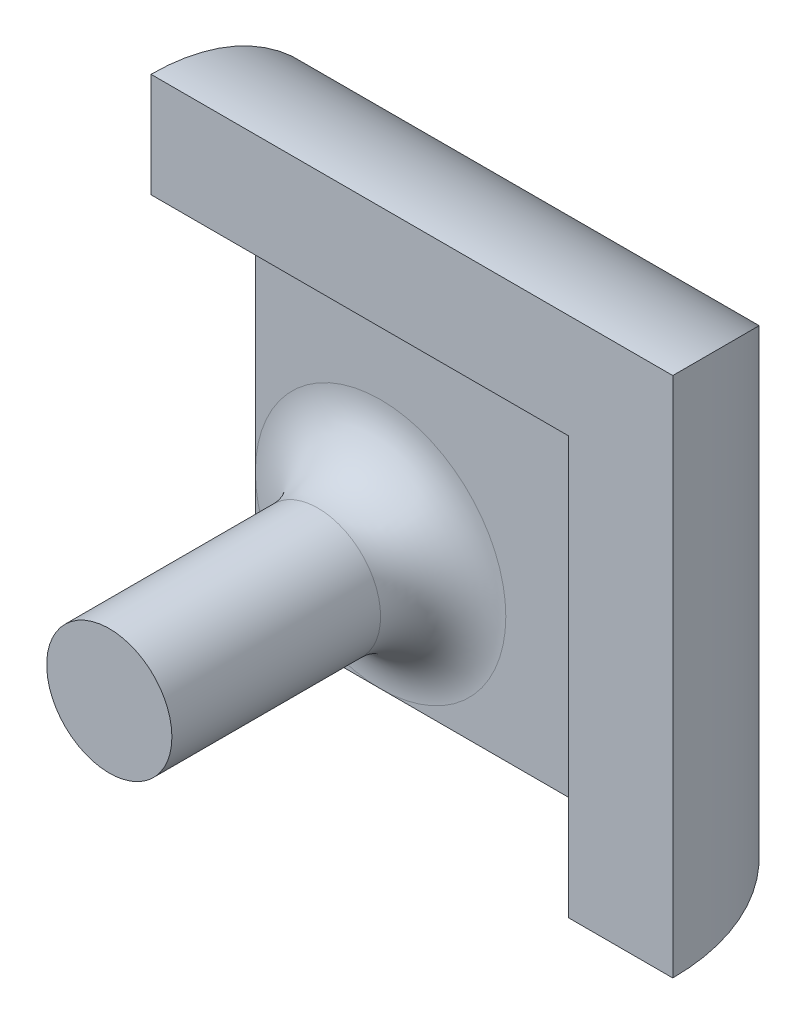
ISO-10303-21;
HEADER;
FILE_DESCRIPTION(('STEP AP214'),'2;1');
FILE_NAME('part.step','',(''),(''),'','','');
FILE_SCHEMA(('AUTOMOTIVE_DESIGN { 1 0 10303 214 1 1 1 1 }'));
ENDSEC;
DATA;
#1=APPLICATION_CONTEXT('core data for automotive mechanical design processes');
#2=APPLICATION_PROTOCOL_DEFINITION('international standard','automotive_design',2000,#1);
#3=PRODUCT_CONTEXT('',#1,'mechanical');
#4=PRODUCT('Part','Part','',(#3));
#5=PRODUCT_RELATED_PRODUCT_CATEGORY('part','',(#4));
#6=PRODUCT_DEFINITION_FORMATION('','',#4);
#7=PRODUCT_DEFINITION_CONTEXT('part definition',#1,'design');
#8=PRODUCT_DEFINITION('design','',#6,#7);
#9=PRODUCT_DEFINITION_SHAPE('','',#8);
#10=(LENGTH_UNIT() NAMED_UNIT(*) SI_UNIT(.MILLI.,.METRE.));
#11=(NAMED_UNIT(*) PLANE_ANGLE_UNIT() SI_UNIT($,.RADIAN.));
#12=(NAMED_UNIT(*) SI_UNIT($,.STERADIAN.) SOLID_ANGLE_UNIT());
#13=UNCERTAINTY_MEASURE_WITH_UNIT(LENGTH_MEASURE(1.E-05),#10,'distance_accuracy_value','');
#14=(GEOMETRIC_REPRESENTATION_CONTEXT(3) GLOBAL_UNCERTAINTY_ASSIGNED_CONTEXT((#13)) GLOBAL_UNIT_ASSIGNED_CONTEXT((#10,
#11,#12)) REPRESENTATION_CONTEXT('',''));
#15=CARTESIAN_POINT('',(0.,0.,0.));
#16=DIRECTION('',(0.,0.,1.));
#17=DIRECTION('',(1.,0.,0.));
#18=AXIS2_PLACEMENT_3D('',#15,#16,#17);
#19=CARTESIAN_POINT('',(0.,0.,5.));
#20=DIRECTION('',(0.,0.,1.));
#21=DIRECTION('',(1.,0.,0.));
#22=AXIS2_PLACEMENT_3D('',#19,#20,#21);
#23=PLANE('',#22);
#24=DIRECTION('',(1.,0.,0.));
#25=VECTOR('',#24,1.);
#26=CARTESIAN_POINT('',(-45.1503681628062,-4.06441717791411,5.));
#27=LINE('',#26,#25);
#28=CARTESIAN_POINT('',(-45.1503681628062,-4.06441717791411,5.));
#29=VERTEX_POINT('',#28);
#30=CARTESIAN_POINT('',(-39.1503681628061,-4.06441717791411,5.));
#31=VERTEX_POINT('',#30);
#32=EDGE_CURVE('E127',#29,#31,#27,.T.);
#33=ORIENTED_EDGE('',*,*,#32,.T.);
#34=CARTESIAN_POINT('',(-39.1503681628061,1.93558282208589,5.));
#35=DIRECTION('',(0.,0.,1.));
#36=DIRECTION('',(1.,0.,0.));
#37=AXIS2_PLACEMENT_3D('',#34,#35,#36);
#38=CIRCLE('',#37,6.);
#39=CARTESIAN_POINT('',(-45.1503681628062,1.9355828220859,5.));
#40=VERTEX_POINT('',#39);
#41=EDGE_CURVE('E12',#31,#40,#38,.F.);
#42=ORIENTED_EDGE('',*,*,#41,.T.);
#43=DIRECTION('',(0.,-1.,0.));
#44=VECTOR('',#43,1.);
#45=CARTESIAN_POINT('',(-45.1503681628062,20.9355828220859,5.));
#46=LINE('',#45,#44);
#47=EDGE_CURVE('E119',#40,#29,#46,.T.);
#48=ORIENTED_EDGE('',*,*,#47,.T.);
#49=EDGE_LOOP('',(#33,#42,#48));
#50=FACE_BOUND('',#49,.T.);
#51=ADVANCED_FACE('F35',(#50),#23,.T.);
#52=CARTESIAN_POINT('',(-45.1503681628062,20.9355828220859,10.));
#53=DIRECTION('',(1.,0.,0.));
#54=DIRECTION('',(0.,1.,0.));
#55=AXIS2_PLACEMENT_3D('',#52,#53,#54);
#56=PLANE('',#55);
#57=CARTESIAN_POINT('',(-45.1503681628062,10.9355828220859,10.));
#58=DIRECTION('',(1.,0.,0.));
#59=DIRECTION('',(0.,1.,0.));
#60=AXIS2_PLACEMENT_3D('',#57,#58,#59);
#61=CIRCLE('',#60,5.);
#62=CARTESIAN_POINT('',(-45.1503681628062,15.9355828220859,10.));
#63=VERTEX_POINT('',#62);
#64=CARTESIAN_POINT('',(-45.1503681628062,10.9355828220859,5.));
#65=VERTEX_POINT('',#64);
#66=EDGE_CURVE('E104',#63,#65,#61,.F.);
#67=ORIENTED_EDGE('',*,*,#66,.F.);
#68=DIRECTION('',(0.,-1.,0.));
#69=VECTOR('',#68,1.);
#70=CARTESIAN_POINT('',(-45.1503681628062,20.9355828220859,10.));
#71=LINE('',#70,#69);
#72=CARTESIAN_POINT('',(-45.1503681628062,20.9355828220859,10.));
#73=VERTEX_POINT('',#72);
#74=EDGE_CURVE('E135',#73,#63,#71,.T.);
#75=ORIENTED_EDGE('',*,*,#74,.F.);
#76=CARTESIAN_POINT('',(-45.1503681628062,10.9355828220859,10.));
#77=DIRECTION('',(1.,0.,0.));
#78=DIRECTION('',(0.,1.,0.));
#79=AXIS2_PLACEMENT_3D('',#76,#77,#78);
#80=CIRCLE('',#79,10.);
#81=CARTESIAN_POINT('',(-45.1503681628062,10.9355828220859,0.));
#82=VERTEX_POINT('',#81);
#83=EDGE_CURVE('E160',#73,#82,#80,.F.);
#84=ORIENTED_EDGE('',*,*,#83,.T.);
#85=DIRECTION('',(0.,-1.,0.));
#86=VECTOR('',#85,1.);
#87=CARTESIAN_POINT('',(-45.1503681628062,20.9355828220859,0.));
#88=LINE('',#87,#86);
#89=CARTESIAN_POINT('',(-45.1503681628062,-4.06441717791411,0.));
#90=VERTEX_POINT('',#89);
#91=EDGE_CURVE('E147',#82,#90,#88,.T.);
#92=ORIENTED_EDGE('',*,*,#91,.T.);
#93=DIRECTION('',(0.,0.,-1.));
#94=VECTOR('',#93,1.);
#95=CARTESIAN_POINT('',(-45.1503681628062,-4.06441717791411,10.));
#96=LINE('',#95,#94);
#97=EDGE_CURVE('E146',#29,#90,#96,.T.);
#98=ORIENTED_EDGE('',*,*,#97,.F.);
#99=ORIENTED_EDGE('',*,*,#47,.F.);
#100=EDGE_CURVE('E122',#65,#40,#46,.T.);
#101=ORIENTED_EDGE('',*,*,#100,.F.);
#102=EDGE_LOOP('',(#67,#75,#84,#92,#98,#99,#101));
#103=FACE_BOUND('',#102,.T.);
#104=ADVANCED_FACE('F178',(#103),#56,.F.);
#105=CARTESIAN_POINT('',(-45.1503681628062,-4.06441717791411,10.));
#106=DIRECTION('',(0.,1.,0.));
#107=DIRECTION('',(0.,0.,1.));
#108=AXIS2_PLACEMENT_3D('',#105,#106,#107);
#109=PLANE('',#108);
#110=ORIENTED_EDGE('',*,*,#32,.F.);
#111=ORIENTED_EDGE('',*,*,#97,.T.);
#112=DIRECTION('',(1.,0.,0.));
#113=VECTOR('',#112,1.);
#114=CARTESIAN_POINT('',(-45.1503681628062,-4.06441717791411,0.));
#115=LINE('',#114,#113);
#116=CARTESIAN_POINT('',(-30.1503681628062,-4.06441717791411,0.));
#117=VERTEX_POINT('',#116);
#118=EDGE_CURVE('E139',#90,#117,#115,.T.);
#119=ORIENTED_EDGE('',*,*,#118,.T.);
#120=CARTESIAN_POINT('',(-30.1503681628062,-4.06441717791411,10.));
#121=DIRECTION('',(0.,1.,0.));
#122=DIRECTION('',(0.,0.,1.));
#123=AXIS2_PLACEMENT_3D('',#120,#121,#122);
#124=CIRCLE('',#123,10.);
#125=CARTESIAN_POINT('',(-20.1503681628062,-4.06441717791411,10.));
#126=VERTEX_POINT('',#125);
#127=EDGE_CURVE('E157',#117,#126,#124,.F.);
#128=ORIENTED_EDGE('',*,*,#127,.T.);
#129=DIRECTION('',(1.,0.,0.));
#130=VECTOR('',#129,1.);
#131=CARTESIAN_POINT('',(-45.1503681628062,-4.06441717791411,10.));
#132=LINE('',#131,#130);
#133=CARTESIAN_POINT('',(-25.1503681628062,-4.06441717791411,10.));
#134=VERTEX_POINT('',#133);
#135=EDGE_CURVE('E138',#134,#126,#132,.T.);
#136=ORIENTED_EDGE('',*,*,#135,.F.);
#137=CARTESIAN_POINT('',(-30.1503681628062,-4.06441717791411,10.));
#138=DIRECTION('',(0.,1.,0.));
#139=DIRECTION('',(0.,0.,1.));
#140=AXIS2_PLACEMENT_3D('',#137,#138,#139);
#141=CIRCLE('',#140,5.);
#142=CARTESIAN_POINT('',(-30.1503681628062,-4.06441717791411,5.));
#143=VERTEX_POINT('',#142);
#144=EDGE_CURVE('E114',#143,#134,#141,.F.);
#145=ORIENTED_EDGE('',*,*,#144,.F.);
#146=EDGE_CURVE('E111',#31,#143,#27,.T.);
#147=ORIENTED_EDGE('',*,*,#146,.F.);
#148=EDGE_LOOP('',(#110,#111,#119,#128,#136,#145,#147));
#149=FACE_BOUND('',#148,.T.);
#150=ADVANCED_FACE('F184',(#149),#109,.F.);
#151=CARTESIAN_POINT('',(0.,0.,10.));
#152=DIRECTION('',(0.,0.,1.));
#153=DIRECTION('',(1.,0.,0.));
#154=AXIS2_PLACEMENT_3D('',#151,#152,#153);
#155=PLANE('',#154);
#156=DIRECTION('',(0.,1.,0.));
#157=VECTOR('',#156,1.);
#158=CARTESIAN_POINT('',(-25.1503681628062,-4.06441717791411,10.));
#159=LINE('',#158,#157);
#160=CARTESIAN_POINT('',(-25.1503681628062,15.9355828220859,10.));
#161=VERTEX_POINT('',#160);
#162=EDGE_CURVE('E118',#134,#161,#159,.T.);
#163=ORIENTED_EDGE('',*,*,#162,.F.);
#164=ORIENTED_EDGE('',*,*,#135,.T.);
#165=DIRECTION('',(0.,1.,0.));
#166=VECTOR('',#165,1.);
#167=CARTESIAN_POINT('',(-20.1503681628062,20.9355828220859,10.));
#168=LINE('',#167,#166);
#169=CARTESIAN_POINT('',(-20.1503681628062,20.9355828220859,10.));
#170=VERTEX_POINT('',#169);
#171=EDGE_CURVE('E141',#126,#170,#168,.T.);
#172=ORIENTED_EDGE('',*,*,#171,.T.);
#173=DIRECTION('',(-1.,0.,0.));
#174=VECTOR('',#173,1.);
#175=CARTESIAN_POINT('',(-45.1503681628062,20.9355828220859,10.));
#176=LINE('',#175,#174);
#177=EDGE_CURVE('E144',#170,#73,#176,.T.);
#178=ORIENTED_EDGE('',*,*,#177,.T.);
#179=ORIENTED_EDGE('',*,*,#74,.T.);
#180=DIRECTION('',(-1.,0.,0.));
#181=VECTOR('',#180,1.);
#182=CARTESIAN_POINT('',(-45.1503681628062,15.9355828220859,10.));
#183=LINE('',#182,#181);
#184=EDGE_CURVE('E107',#161,#63,#183,.T.);
#185=ORIENTED_EDGE('',*,*,#184,.F.);
#186=EDGE_LOOP('',(#163,#164,#172,#178,#179,#185));
#187=FACE_BOUND('',#186,.T.);
#188=ADVANCED_FACE('F206',(#187),#155,.T.);
#189=CARTESIAN_POINT('',(0.,0.,0.));
#190=DIRECTION('',(0.,0.,1.));
#191=DIRECTION('',(1.,0.,0.));
#192=AXIS2_PLACEMENT_3D('',#189,#190,#191);
#193=PLANE('',#192);
#194=DIRECTION('',(-1.,0.,0.));
#195=VECTOR('',#194,1.);
#196=CARTESIAN_POINT('',(0.,10.9355828220859,0.));
#197=LINE('',#196,#195);
#198=CARTESIAN_POINT('',(-30.1503681628062,10.9355828220859,0.));
#199=VERTEX_POINT('',#198);
#200=EDGE_CURVE('E153',#82,#199,#197,.F.);
#201=ORIENTED_EDGE('',*,*,#200,.T.);
#202=DIRECTION('',(0.,1.,0.));
#203=VECTOR('',#202,1.);
#204=CARTESIAN_POINT('',(-30.1503681628062,0.,0.));
#205=LINE('',#204,#203);
#206=EDGE_CURVE('E155',#199,#117,#205,.F.);
#207=ORIENTED_EDGE('',*,*,#206,.T.);
#208=ORIENTED_EDGE('',*,*,#118,.F.);
#209=ORIENTED_EDGE('',*,*,#91,.F.);
#210=EDGE_LOOP('',(#201,#207,#208,#209));
#211=FACE_BOUND('',#210,.T.);
#212=ADVANCED_FACE('F200',(#211),#193,.F.);
#213=CARTESIAN_POINT('',(-45.1503681628062,10.9355828220859,10.));
#214=DIRECTION('',(-1.,0.,0.));
#215=DIRECTION('',(0.,0.,1.));
#216=AXIS2_PLACEMENT_3D('',#213,#214,#215);
#217=CYLINDRICAL_SURFACE('',#216,10.);
#218=ORIENTED_EDGE('',*,*,#83,.F.);
#219=ORIENTED_EDGE('',*,*,#177,.F.);
#220=CARTESIAN_POINT('',(-30.1503681628062,10.9355828220859,10.));
#221=DIRECTION('',(-0.707106781186548,0.707106781186547,0.));
#222=DIRECTION('',(-0.707106781186547,-0.707106781186548,0.));
#223=AXIS2_PLACEMENT_3D('',#220,#221,#222);
#224=ELLIPSE('',#223,14.1421356237309,10.);
#225=EDGE_CURVE('E133',#199,#170,#224,.F.);
#226=ORIENTED_EDGE('',*,*,#225,.F.);
#227=ORIENTED_EDGE('',*,*,#200,.F.);
#228=EDGE_LOOP('',(#218,#219,#226,#227));
#229=FACE_BOUND('',#228,.T.);
#230=ADVANCED_FACE('F194',(#229),#217,.T.);
#231=CARTESIAN_POINT('',(-30.1503681628062,20.9355828220859,10.));
#232=DIRECTION('',(0.,1.,0.));
#233=DIRECTION('',(-1.,0.,0.));
#234=AXIS2_PLACEMENT_3D('',#231,#232,#233);
#235=CYLINDRICAL_SURFACE('',#234,10.);
#236=ORIENTED_EDGE('',*,*,#127,.F.);
#237=ORIENTED_EDGE('',*,*,#206,.F.);
#238=ORIENTED_EDGE('',*,*,#225,.T.);
#239=ORIENTED_EDGE('',*,*,#171,.F.);
#240=EDGE_LOOP('',(#236,#237,#238,#239));
#241=FACE_BOUND('',#240,.T.);
#242=ADVANCED_FACE('F189',(#241),#235,.T.);
#243=ORIENTED_EDGE('',*,*,#100,.T.);
#244=CARTESIAN_POINT('',(-39.1503681628061,1.93558282208589,5.));
#245=DIRECTION('',(0.,0.,1.));
#246=DIRECTION('',(1.,0.,0.));
#247=AXIS2_PLACEMENT_3D('',#244,#245,#246);
#248=CIRCLE('',#247,6.);
#249=EDGE_CURVE('E43',#40,#31,#248,.F.);
#250=ORIENTED_EDGE('',*,*,#249,.T.);
#251=ORIENTED_EDGE('',*,*,#146,.T.);
#252=DIRECTION('',(0.,1.,0.));
#253=VECTOR('',#252,1.);
#254=CARTESIAN_POINT('',(-30.1503681628062,0.,5.));
#255=LINE('',#254,#253);
#256=CARTESIAN_POINT('',(-30.1503681628062,10.9355828220859,5.));
#257=VERTEX_POINT('',#256);
#258=EDGE_CURVE('E106',#257,#143,#255,.F.);
#259=ORIENTED_EDGE('',*,*,#258,.F.);
#260=DIRECTION('',(1.,0.,0.));
#261=VECTOR('',#260,1.);
#262=CARTESIAN_POINT('',(0.,10.9355828220859,5.));
#263=LINE('',#262,#261);
#264=EDGE_CURVE('E97',#65,#257,#263,.T.);
#265=ORIENTED_EDGE('',*,*,#264,.F.);
#266=EDGE_LOOP('',(#243,#250,#251,#259,#265));
#267=FACE_BOUND('',#266,.T.);
#268=ADVANCED_FACE('F110',(#267),#23,.T.);
#269=CARTESIAN_POINT('',(-45.1503681628062,10.9355828220859,10.));
#270=DIRECTION('',(-1.,0.,0.));
#271=DIRECTION('',(0.,0.,1.));
#272=AXIS2_PLACEMENT_3D('',#269,#270,#271);
#273=CYLINDRICAL_SURFACE('',#272,5.);
#274=ORIENTED_EDGE('',*,*,#66,.T.);
#275=ORIENTED_EDGE('',*,*,#264,.T.);
#276=CARTESIAN_POINT('',(-30.1503681628062,10.9355828220859,10.));
#277=DIRECTION('',(-0.707106781186548,0.707106781186547,0.));
#278=DIRECTION('',(0.707106781186547,0.707106781186548,0.));
#279=AXIS2_PLACEMENT_3D('',#276,#277,#278);
#280=ELLIPSE('',#279,7.07106781186547,5.);
#281=EDGE_CURVE('E101',#257,#161,#280,.F.);
#282=ORIENTED_EDGE('',*,*,#281,.T.);
#283=ORIENTED_EDGE('',*,*,#184,.T.);
#284=EDGE_LOOP('',(#274,#275,#282,#283));
#285=FACE_BOUND('',#284,.T.);
#286=ADVANCED_FACE('F99',(#285),#273,.F.);
#287=CARTESIAN_POINT('',(-30.1503681628062,20.9355828220859,10.));
#288=DIRECTION('',(0.,1.,0.));
#289=DIRECTION('',(-1.,0.,0.));
#290=AXIS2_PLACEMENT_3D('',#287,#288,#289);
#291=CYLINDRICAL_SURFACE('',#290,5.);
#292=ORIENTED_EDGE('',*,*,#144,.T.);
#293=ORIENTED_EDGE('',*,*,#162,.T.);
#294=ORIENTED_EDGE('',*,*,#281,.F.);
#295=ORIENTED_EDGE('',*,*,#258,.T.);
#296=EDGE_LOOP('',(#292,#293,#294,#295));
#297=FACE_BOUND('',#296,.T.);
#298=ADVANCED_FACE('F116',(#297),#291,.F.);
#299=CARTESIAN_POINT('',(-39.1503681628061,1.93558282208589,34.4852813742386));
#300=DIRECTION('',(0.,0.,-1.));
#301=DIRECTION('',(-1.,0.,0.));
#302=AXIS2_PLACEMENT_3D('',#299,#300,#301);
#303=CYLINDRICAL_SURFACE('',#302,3.);
#304=CARTESIAN_POINT('',(-39.1503681628061,1.93558282208589,8.));
#305=DIRECTION('',(0.,0.,1.));
#306=DIRECTION('',(1.,0.,0.));
#307=AXIS2_PLACEMENT_3D('',#304,#305,#306);
#308=CIRCLE('',#307,3.);
#309=CARTESIAN_POINT('',(-36.1503681628061,1.93558282208589,8.));
#310=VERTEX_POINT('',#309);
#311=EDGE_CURVE('E162',#310,#310,#308,.T.);
#312=ORIENTED_EDGE('',*,*,#311,.T.);
#313=EDGE_LOOP('',(#312));
#314=FACE_BOUND('',#313,.T.);
#315=CARTESIAN_POINT('',(-39.1503681628061,1.93558282208589,18.));
#316=DIRECTION('',(0.,0.,1.));
#317=DIRECTION('',(1.,0.,0.));
#318=AXIS2_PLACEMENT_3D('',#315,#316,#317);
#319=CIRCLE('',#318,3.);
#320=CARTESIAN_POINT('',(-36.1503681628061,1.93558282208589,18.));
#321=VERTEX_POINT('',#320);
#322=EDGE_CURVE('E120',#321,#321,#319,.T.);
#323=ORIENTED_EDGE('',*,*,#322,.F.);
#324=EDGE_LOOP('',(#323));
#325=FACE_BOUND('',#324,.T.);
#326=ADVANCED_FACE('F167',(#314,#325),#303,.T.);
#327=CARTESIAN_POINT('',(0.,0.,18.));
#328=DIRECTION('',(0.,0.,1.));
#329=DIRECTION('',(1.,0.,0.));
#330=AXIS2_PLACEMENT_3D('',#327,#328,#329);
#331=PLANE('',#330);
#332=ORIENTED_EDGE('',*,*,#322,.T.);
#333=EDGE_LOOP('',(#332));
#334=FACE_BOUND('',#333,.T.);
#335=ADVANCED_FACE('F171',(#334),#331,.T.);
#336=CARTESIAN_POINT('',(-39.1503681628061,1.93558282208589,8.));
#337=DIRECTION('',(0.,0.,1.));
#338=DIRECTION('',(1.,0.,0.));
#339=AXIS2_PLACEMENT_3D('',#336,#337,#338);
#340=TOROIDAL_SURFACE('',#339,6.,3.);
#341=ORIENTED_EDGE('',*,*,#249,.F.);
#342=ORIENTED_EDGE('',*,*,#41,.F.);
#343=EDGE_LOOP('',(#341,#342));
#344=FACE_BOUND('',#343,.T.);
#345=ORIENTED_EDGE('',*,*,#311,.F.);
#346=EDGE_LOOP('',(#345));
#347=FACE_BOUND('',#346,.T.);
#348=ADVANCED_FACE('F37',(#344,#347),#340,.F.);
#349=CLOSED_SHELL('',(#51,#104,#150,#188,#212,#230,#242,#268,#286,#298,#326,#335,#348));
#350=MANIFOLD_SOLID_BREP('B2',#349);
#351=ADVANCED_BREP_SHAPE_REPRESENTATION('',(#18,#350),#14);
#352=SHAPE_DEFINITION_REPRESENTATION(#9,#351);
ENDSEC;
END-ISO-10303-21;
